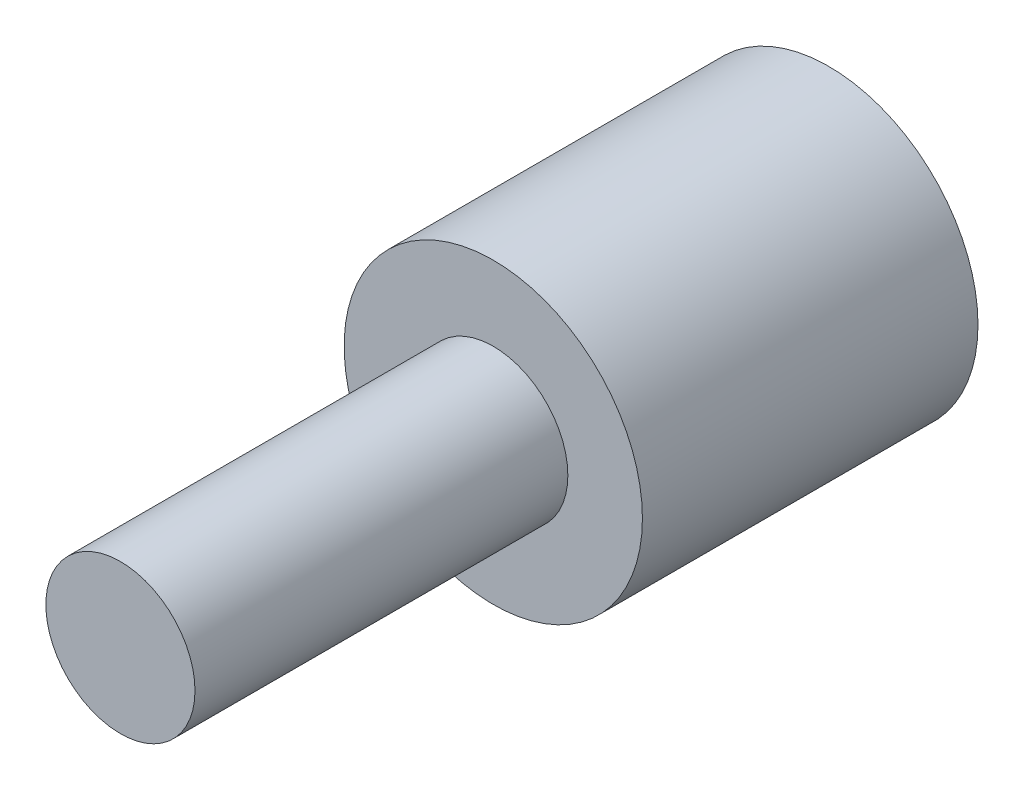
ISO-10303-21;
HEADER;
FILE_DESCRIPTION(('STEP AP214'),'2;1');
FILE_NAME('part.step','',(''),(''),'','','');
FILE_SCHEMA(('AUTOMOTIVE_DESIGN { 1 0 10303 214 1 1 1 1 }'));
ENDSEC;
DATA;
#1=APPLICATION_CONTEXT('core data for automotive mechanical design processes');
#2=APPLICATION_PROTOCOL_DEFINITION('international standard','automotive_design',2000,#1);
#3=PRODUCT_CONTEXT('',#1,'mechanical');
#4=PRODUCT('Part','Part','',(#3));
#5=PRODUCT_RELATED_PRODUCT_CATEGORY('part','',(#4));
#6=PRODUCT_DEFINITION_FORMATION('','',#4);
#7=PRODUCT_DEFINITION_CONTEXT('part definition',#1,'design');
#8=PRODUCT_DEFINITION('design','',#6,#7);
#9=PRODUCT_DEFINITION_SHAPE('','',#8);
#10=(LENGTH_UNIT() NAMED_UNIT(*) SI_UNIT(.MILLI.,.METRE.));
#11=(NAMED_UNIT(*) PLANE_ANGLE_UNIT() SI_UNIT($,.RADIAN.));
#12=(NAMED_UNIT(*) SI_UNIT($,.STERADIAN.) SOLID_ANGLE_UNIT());
#13=UNCERTAINTY_MEASURE_WITH_UNIT(LENGTH_MEASURE(1.E-05),#10,'distance_accuracy_value','');
#14=(GEOMETRIC_REPRESENTATION_CONTEXT(3) GLOBAL_UNCERTAINTY_ASSIGNED_CONTEXT((#13)) GLOBAL_UNIT_ASSIGNED_CONTEXT((#10,
#11,#12)) REPRESENTATION_CONTEXT('',''));
#15=CARTESIAN_POINT('',(0.,0.,0.));
#16=DIRECTION('',(0.,0.,1.));
#17=DIRECTION('',(1.,0.,0.));
#18=AXIS2_PLACEMENT_3D('',#15,#16,#17);
#19=CARTESIAN_POINT('',(0.,0.,-95.));
#20=DIRECTION('',(0.,0.,1.));
#21=DIRECTION('',(1.,0.,0.));
#22=AXIS2_PLACEMENT_3D('',#19,#20,#21);
#23=PLANE('',#22);
#24=CARTESIAN_POINT('',(0.,0.,-95.));
#25=DIRECTION('',(0.,0.,1.));
#26=DIRECTION('',(1.,0.,0.));
#27=AXIS2_PLACEMENT_3D('',#24,#25,#26);
#28=CIRCLE('',#27,20.);
#29=CARTESIAN_POINT('',(20.,0.,-95.));
#30=VERTEX_POINT('',#29);
#31=EDGE_CURVE('E10',#30,#30,#28,.T.);
#32=ORIENTED_EDGE('',*,*,#31,.F.);
#33=EDGE_LOOP('',(#32));
#34=FACE_BOUND('',#33,.T.);
#35=ADVANCED_FACE('F31',(#34),#23,.F.);
#36=CARTESIAN_POINT('',(0.,0.,0.));
#37=DIRECTION('',(0.,0.,1.));
#38=DIRECTION('',(1.,0.,0.));
#39=AXIS2_PLACEMENT_3D('',#36,#37,#38);
#40=CYLINDRICAL_SURFACE('',#39,20.);
#41=CARTESIAN_POINT('',(0.,0.,-50.));
#42=DIRECTION('',(0.,0.,1.));
#43=DIRECTION('',(1.,0.,0.));
#44=AXIS2_PLACEMENT_3D('',#41,#42,#43);
#45=CIRCLE('',#44,20.);
#46=CARTESIAN_POINT('',(20.,0.,-50.));
#47=VERTEX_POINT('',#46);
#48=EDGE_CURVE('E37',#47,#47,#45,.T.);
#49=ORIENTED_EDGE('',*,*,#48,.F.);
#50=EDGE_LOOP('',(#49));
#51=FACE_BOUND('',#50,.T.);
#52=ORIENTED_EDGE('',*,*,#31,.T.);
#53=EDGE_LOOP('',(#52));
#54=FACE_BOUND('',#53,.T.);
#55=ADVANCED_FACE('F61',(#51,#54),#40,.T.);
#56=CARTESIAN_POINT('',(0.,20.,-50.));
#57=DIRECTION('',(0.,0.,-1.));
#58=DIRECTION('',(-1.,0.,0.));
#59=AXIS2_PLACEMENT_3D('',#56,#57,#58);
#60=PLANE('',#59);
#61=CARTESIAN_POINT('',(0.,0.,-50.));
#62=DIRECTION('',(0.,0.,1.));
#63=DIRECTION('',(1.,0.,0.));
#64=AXIS2_PLACEMENT_3D('',#61,#62,#63);
#65=CIRCLE('',#64,10.);
#66=CARTESIAN_POINT('',(10.,0.,-50.));
#67=VERTEX_POINT('',#66);
#68=EDGE_CURVE('E41',#67,#67,#65,.T.);
#69=ORIENTED_EDGE('',*,*,#68,.F.);
#70=EDGE_LOOP('',(#69));
#71=FACE_BOUND('',#70,.T.);
#72=ORIENTED_EDGE('',*,*,#48,.T.);
#73=EDGE_LOOP('',(#72));
#74=FACE_BOUND('',#73,.T.);
#75=ADVANCED_FACE('F56',(#71,#74),#60,.F.);
#76=CARTESIAN_POINT('',(0.,0.,0.));
#77=DIRECTION('',(0.,0.,1.));
#78=DIRECTION('',(1.,0.,0.));
#79=AXIS2_PLACEMENT_3D('',#76,#77,#78);
#80=CYLINDRICAL_SURFACE('',#79,9.99999999999999);
#81=CARTESIAN_POINT('',(0.,0.,0.));
#82=DIRECTION('',(0.,0.,1.));
#83=DIRECTION('',(1.,0.,0.));
#84=AXIS2_PLACEMENT_3D('',#81,#82,#83);
#85=CIRCLE('',#84,9.99999999999999);
#86=CARTESIAN_POINT('',(9.99999999999999,0.,0.));
#87=VERTEX_POINT('',#86);
#88=EDGE_CURVE('E45',#87,#87,#85,.T.);
#89=ORIENTED_EDGE('',*,*,#88,.F.);
#90=EDGE_LOOP('',(#89));
#91=FACE_BOUND('',#90,.T.);
#92=ORIENTED_EDGE('',*,*,#68,.T.);
#93=EDGE_LOOP('',(#92));
#94=FACE_BOUND('',#93,.T.);
#95=ADVANCED_FACE('F53',(#91,#94),#80,.T.);
#96=CARTESIAN_POINT('',(0.,9.99999999999999,0.));
#97=DIRECTION('',(0.,0.,-1.));
#98=DIRECTION('',(-1.,0.,0.));
#99=AXIS2_PLACEMENT_3D('',#96,#97,#98);
#100=PLANE('',#99);
#101=ORIENTED_EDGE('',*,*,#88,.T.);
#102=EDGE_LOOP('',(#101));
#103=FACE_BOUND('',#102,.T.);
#104=ADVANCED_FACE('F51',(#103),#100,.F.);
#105=CLOSED_SHELL('',(#35,#55,#75,#95,#104));
#106=MANIFOLD_SOLID_BREP('B2',#105);
#107=ADVANCED_BREP_SHAPE_REPRESENTATION('',(#18,#106),#14);
#108=SHAPE_DEFINITION_REPRESENTATION(#9,#107);
ENDSEC;
END-ISO-10303-21;
